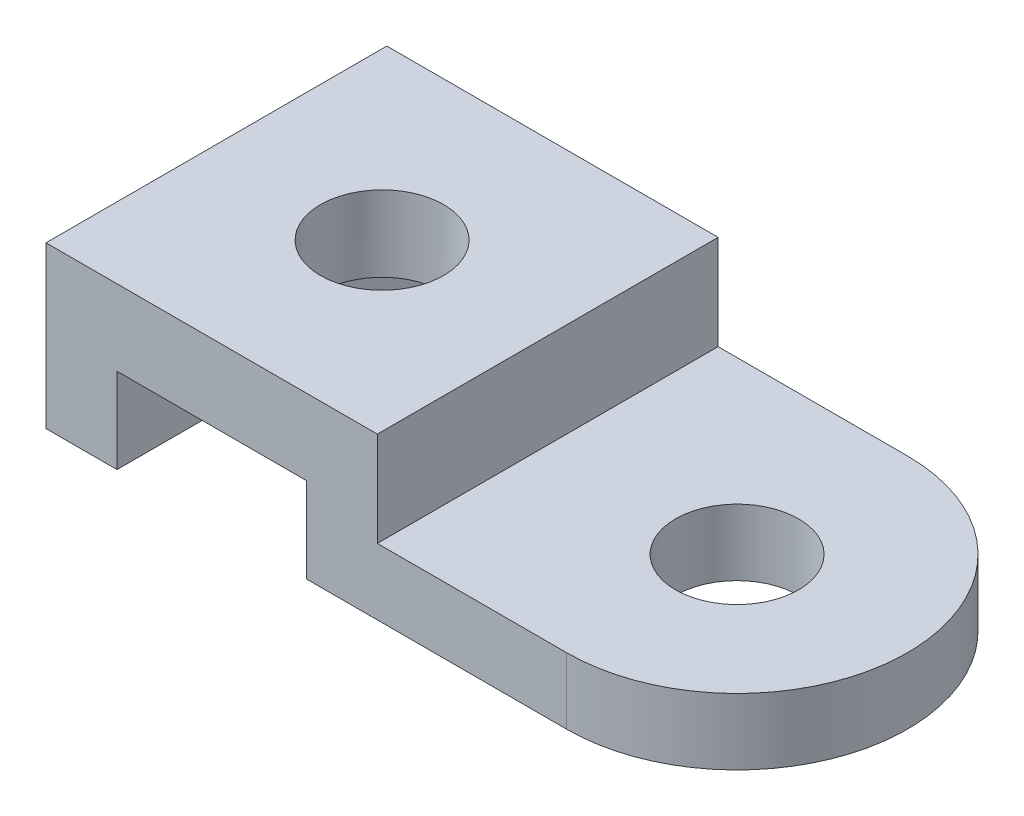
ISO-10303-21;
HEADER;
FILE_DESCRIPTION(('STEP AP214'),'2;1');
FILE_NAME('part.step','',(''),(''),'','','');
FILE_SCHEMA(('AUTOMOTIVE_DESIGN { 1 0 10303 214 1 1 1 1 }'));
ENDSEC;
DATA;
#1=APPLICATION_CONTEXT('core data for automotive mechanical design processes');
#2=APPLICATION_PROTOCOL_DEFINITION('international standard','automotive_design',2000,#1);
#3=PRODUCT_CONTEXT('',#1,'mechanical');
#4=PRODUCT('Part','Part','',(#3));
#5=PRODUCT_RELATED_PRODUCT_CATEGORY('part','',(#4));
#6=PRODUCT_DEFINITION_FORMATION('','',#4);
#7=PRODUCT_DEFINITION_CONTEXT('part definition',#1,'design');
#8=PRODUCT_DEFINITION('design','',#6,#7);
#9=PRODUCT_DEFINITION_SHAPE('','',#8);
#10=(LENGTH_UNIT() NAMED_UNIT(*) SI_UNIT(.MILLI.,.METRE.));
#11=(NAMED_UNIT(*) PLANE_ANGLE_UNIT() SI_UNIT($,.RADIAN.));
#12=(NAMED_UNIT(*) SI_UNIT($,.STERADIAN.) SOLID_ANGLE_UNIT());
#13=UNCERTAINTY_MEASURE_WITH_UNIT(LENGTH_MEASURE(1.E-05),#10,'distance_accuracy_value','');
#14=(GEOMETRIC_REPRESENTATION_CONTEXT(3) GLOBAL_UNCERTAINTY_ASSIGNED_CONTEXT((#13)) GLOBAL_UNIT_ASSIGNED_CONTEXT((#10,
#11,#12)) REPRESENTATION_CONTEXT('',''));
#15=CARTESIAN_POINT('',(0.,0.,0.));
#16=DIRECTION('',(0.,0.,1.));
#17=DIRECTION('',(1.,0.,0.));
#18=AXIS2_PLACEMENT_3D('',#15,#16,#17);
#19=CARTESIAN_POINT('',(0.,-34.,36.));
#20=DIRECTION('',(0.,0.,1.));
#21=DIRECTION('',(1.,0.,0.));
#22=AXIS2_PLACEMENT_3D('',#19,#20,#21);
#23=PLANE('',#22);
#24=DIRECTION('',(0.,-1.,0.));
#25=VECTOR('',#24,1.);
#26=CARTESIAN_POINT('',(35.,0.,36.));
#27=LINE('',#26,#25);
#28=CARTESIAN_POINT('',(35.,0.,36.));
#29=VERTEX_POINT('',#28);
#30=CARTESIAN_POINT('',(35.,-20.,36.));
#31=VERTEX_POINT('',#30);
#32=EDGE_CURVE('E220',#29,#31,#27,.T.);
#33=ORIENTED_EDGE('',*,*,#32,.F.);
#34=DIRECTION('',(1.,0.,0.));
#35=VECTOR('',#34,1.);
#36=CARTESIAN_POINT('',(0.,0.,36.));
#37=LINE('',#36,#35);
#38=CARTESIAN_POINT('',(-35.,0.,36.));
#39=VERTEX_POINT('',#38);
#40=EDGE_CURVE('E271',#39,#29,#37,.T.);
#41=ORIENTED_EDGE('',*,*,#40,.F.);
#42=DIRECTION('',(0.,1.,0.));
#43=VECTOR('',#42,1.);
#44=CARTESIAN_POINT('',(-35.,-34.,36.));
#45=LINE('',#44,#43);
#46=CARTESIAN_POINT('',(-35.,-34.,36.));
#47=VERTEX_POINT('',#46);
#48=EDGE_CURVE('E104',#47,#39,#45,.T.);
#49=ORIENTED_EDGE('',*,*,#48,.F.);
#50=DIRECTION('',(1.,0.,0.));
#51=VECTOR('',#50,1.);
#52=CARTESIAN_POINT('',(0.,-34.,36.));
#53=LINE('',#52,#51);
#54=CARTESIAN_POINT('',(-20.,-34.,36.));
#55=VERTEX_POINT('',#54);
#56=EDGE_CURVE('E251',#47,#55,#53,.T.);
#57=ORIENTED_EDGE('',*,*,#56,.T.);
#58=DIRECTION('',(0.,1.,0.));
#59=VECTOR('',#58,1.);
#60=CARTESIAN_POINT('',(-20.,-34.,36.));
#61=LINE('',#60,#59);
#62=CARTESIAN_POINT('',(-20.,-16.,36.));
#63=VERTEX_POINT('',#62);
#64=EDGE_CURVE('E192',#55,#63,#61,.T.);
#65=ORIENTED_EDGE('',*,*,#64,.T.);
#66=DIRECTION('',(1.,0.,0.));
#67=VECTOR('',#66,1.);
#68=CARTESIAN_POINT('',(-20.,-16.,36.));
#69=LINE('',#68,#67);
#70=CARTESIAN_POINT('',(20.,-16.,36.));
#71=VERTEX_POINT('',#70);
#72=EDGE_CURVE('E211',#63,#71,#69,.T.);
#73=ORIENTED_EDGE('',*,*,#72,.T.);
#74=DIRECTION('',(0.,-1.,0.));
#75=VECTOR('',#74,1.);
#76=CARTESIAN_POINT('',(20.,-16.,36.));
#77=LINE('',#76,#75);
#78=CARTESIAN_POINT('',(20.,-34.,36.));
#79=VERTEX_POINT('',#78);
#80=EDGE_CURVE('E175',#71,#79,#77,.T.);
#81=ORIENTED_EDGE('',*,*,#80,.T.);
#82=CARTESIAN_POINT('',(75.,-34.,36.));
#83=VERTEX_POINT('',#82);
#84=EDGE_CURVE('E249',#79,#83,#53,.T.);
#85=ORIENTED_EDGE('',*,*,#84,.T.);
#86=DIRECTION('',(0.,1.,0.));
#87=VECTOR('',#86,1.);
#88=CARTESIAN_POINT('',(75.,-34.,36.));
#89=LINE('',#88,#87);
#90=CARTESIAN_POINT('',(75.,-20.,36.));
#91=VERTEX_POINT('',#90);
#92=EDGE_CURVE('E266',#83,#91,#89,.T.);
#93=ORIENTED_EDGE('',*,*,#92,.T.);
#94=DIRECTION('',(-1.,0.,0.));
#95=VECTOR('',#94,1.);
#96=CARTESIAN_POINT('',(75.,-20.,36.));
#97=LINE('',#96,#95);
#98=EDGE_CURVE('E216',#91,#31,#97,.T.);
#99=ORIENTED_EDGE('',*,*,#98,.T.);
#100=EDGE_LOOP('',(#33,#41,#49,#57,#65,#73,#81,#85,#93,#99));
#101=FACE_BOUND('',#100,.T.);
#102=ADVANCED_FACE('F94',(#101),#23,.T.);
#103=CARTESIAN_POINT('',(0.,-34.,-36.));
#104=DIRECTION('',(0.,0.,1.));
#105=DIRECTION('',(1.,0.,0.));
#106=AXIS2_PLACEMENT_3D('',#103,#104,#105);
#107=PLANE('',#106);
#108=DIRECTION('',(1.,0.,0.));
#109=VECTOR('',#108,1.);
#110=CARTESIAN_POINT('',(0.,0.,-36.));
#111=LINE('',#110,#109);
#112=CARTESIAN_POINT('',(-35.,0.,-36.));
#113=VERTEX_POINT('',#112);
#114=CARTESIAN_POINT('',(35.,0.,-36.));
#115=VERTEX_POINT('',#114);
#116=EDGE_CURVE('E275',#113,#115,#111,.T.);
#117=ORIENTED_EDGE('',*,*,#116,.T.);
#118=DIRECTION('',(0.,-1.,0.));
#119=VECTOR('',#118,1.);
#120=CARTESIAN_POINT('',(35.,0.,-36.));
#121=LINE('',#120,#119);
#122=CARTESIAN_POINT('',(35.,-20.,-36.));
#123=VERTEX_POINT('',#122);
#124=EDGE_CURVE('E119',#115,#123,#121,.T.);
#125=ORIENTED_EDGE('',*,*,#124,.T.);
#126=DIRECTION('',(1.,0.,0.));
#127=VECTOR('',#126,1.);
#128=CARTESIAN_POINT('',(75.,-20.,-36.));
#129=LINE('',#128,#127);
#130=CARTESIAN_POINT('',(75.,-20.,-36.));
#131=VERTEX_POINT('',#130);
#132=EDGE_CURVE('E201',#123,#131,#129,.T.);
#133=ORIENTED_EDGE('',*,*,#132,.T.);
#134=DIRECTION('',(0.,1.,0.));
#135=VECTOR('',#134,1.);
#136=CARTESIAN_POINT('',(75.,-34.,-36.));
#137=LINE('',#136,#135);
#138=CARTESIAN_POINT('',(75.,-34.,-36.));
#139=VERTEX_POINT('',#138);
#140=EDGE_CURVE('E287',#139,#131,#137,.T.);
#141=ORIENTED_EDGE('',*,*,#140,.F.);
#142=DIRECTION('',(1.,0.,0.));
#143=VECTOR('',#142,1.);
#144=CARTESIAN_POINT('',(0.,-34.,-36.));
#145=LINE('',#144,#143);
#146=CARTESIAN_POINT('',(20.,-34.,-36.));
#147=VERTEX_POINT('',#146);
#148=EDGE_CURVE('E199',#147,#139,#145,.T.);
#149=ORIENTED_EDGE('',*,*,#148,.F.);
#150=DIRECTION('',(0.,-1.,0.));
#151=VECTOR('',#150,1.);
#152=CARTESIAN_POINT('',(20.,-16.,-36.));
#153=LINE('',#152,#151);
#154=CARTESIAN_POINT('',(20.,-16.,-36.));
#155=VERTEX_POINT('',#154);
#156=EDGE_CURVE('E111',#155,#147,#153,.T.);
#157=ORIENTED_EDGE('',*,*,#156,.F.);
#158=DIRECTION('',(1.,0.,0.));
#159=VECTOR('',#158,1.);
#160=CARTESIAN_POINT('',(-20.,-16.,-36.));
#161=LINE('',#160,#159);
#162=CARTESIAN_POINT('',(-20.,-16.,-36.));
#163=VERTEX_POINT('',#162);
#164=EDGE_CURVE('E184',#163,#155,#161,.T.);
#165=ORIENTED_EDGE('',*,*,#164,.F.);
#166=DIRECTION('',(0.,1.,0.));
#167=VECTOR('',#166,1.);
#168=CARTESIAN_POINT('',(-20.,-34.,-36.));
#169=LINE('',#168,#167);
#170=CARTESIAN_POINT('',(-20.,-34.,-36.));
#171=VERTEX_POINT('',#170);
#172=EDGE_CURVE('E181',#171,#163,#169,.T.);
#173=ORIENTED_EDGE('',*,*,#172,.F.);
#174=CARTESIAN_POINT('',(-35.,-34.,-36.));
#175=VERTEX_POINT('',#174);
#176=EDGE_CURVE('E258',#175,#171,#145,.T.);
#177=ORIENTED_EDGE('',*,*,#176,.F.);
#178=DIRECTION('',(0.,1.,0.));
#179=VECTOR('',#178,1.);
#180=CARTESIAN_POINT('',(-35.,-34.,-36.));
#181=LINE('',#180,#179);
#182=EDGE_CURVE('E283',#175,#113,#181,.T.);
#183=ORIENTED_EDGE('',*,*,#182,.T.);
#184=EDGE_LOOP('',(#117,#125,#133,#141,#149,#157,#165,#173,#177,#183));
#185=FACE_BOUND('',#184,.T.);
#186=ADVANCED_FACE('F196',(#185),#107,.F.);
#187=CARTESIAN_POINT('',(0.,-34.,0.));
#188=DIRECTION('',(0.,1.,0.));
#189=DIRECTION('',(0.,0.,1.));
#190=AXIS2_PLACEMENT_3D('',#187,#188,#189);
#191=CYLINDRICAL_SURFACE('',#190,13.);
#192=CARTESIAN_POINT('',(0.,0.,0.));
#193=DIRECTION('',(0.,1.,0.));
#194=DIRECTION('',(0.,0.,1.));
#195=AXIS2_PLACEMENT_3D('',#192,#193,#194);
#196=CIRCLE('',#195,13.);
#197=CARTESIAN_POINT('',(0.,0.,13.));
#198=VERTEX_POINT('',#197);
#199=EDGE_CURVE('E267',#198,#198,#196,.T.);
#200=ORIENTED_EDGE('',*,*,#199,.T.);
#201=EDGE_LOOP('',(#200));
#202=FACE_BOUND('',#201,.T.);
#203=CARTESIAN_POINT('',(0.,-16.,0.));
#204=DIRECTION('',(0.,-1.,0.));
#205=DIRECTION('',(0.,0.,-1.));
#206=AXIS2_PLACEMENT_3D('',#203,#204,#205);
#207=CIRCLE('',#206,13.);
#208=CARTESIAN_POINT('',(0.,-16.,-13.));
#209=VERTEX_POINT('',#208);
#210=EDGE_CURVE('E98',#209,#209,#207,.F.);
#211=ORIENTED_EDGE('',*,*,#210,.F.);
#212=EDGE_LOOP('',(#211));
#213=FACE_BOUND('',#212,.T.);
#214=ADVANCED_FACE('F336',(#202,#213),#191,.F.);
#215=CARTESIAN_POINT('',(75.,-34.,0.));
#216=DIRECTION('',(0.,1.,0.));
#217=DIRECTION('',(0.,0.,1.));
#218=AXIS2_PLACEMENT_3D('',#215,#216,#217);
#219=CYLINDRICAL_SURFACE('',#218,13.);
#220=CARTESIAN_POINT('',(75.,-34.,0.));
#221=DIRECTION('',(0.,1.,0.));
#222=DIRECTION('',(0.,0.,1.));
#223=AXIS2_PLACEMENT_3D('',#220,#221,#222);
#224=CIRCLE('',#223,13.);
#225=CARTESIAN_POINT('',(75.,-34.,13.));
#226=VERTEX_POINT('',#225);
#227=EDGE_CURVE('E245',#226,#226,#224,.T.);
#228=ORIENTED_EDGE('',*,*,#227,.F.);
#229=EDGE_LOOP('',(#228));
#230=FACE_BOUND('',#229,.T.);
#231=CARTESIAN_POINT('',(75.,-20.,0.));
#232=DIRECTION('',(0.,1.,0.));
#233=DIRECTION('',(-1.,0.,0.));
#234=AXIS2_PLACEMENT_3D('',#231,#232,#233);
#235=CIRCLE('',#234,13.);
#236=CARTESIAN_POINT('',(62.,-20.,0.));
#237=VERTEX_POINT('',#236);
#238=EDGE_CURVE('E229',#237,#237,#235,.F.);
#239=ORIENTED_EDGE('',*,*,#238,.F.);
#240=EDGE_LOOP('',(#239));
#241=FACE_BOUND('',#240,.T.);
#242=ADVANCED_FACE('F96',(#230,#241),#219,.F.);
#243=CARTESIAN_POINT('',(75.,-34.,0.));
#244=DIRECTION('',(0.,1.,0.));
#245=DIRECTION('',(0.,0.,1.));
#246=AXIS2_PLACEMENT_3D('',#243,#244,#245);
#247=CYLINDRICAL_SURFACE('',#246,36.);
#248=CARTESIAN_POINT('',(75.,-34.,0.));
#249=DIRECTION('',(0.,1.,0.));
#250=DIRECTION('',(0.,0.,1.));
#251=AXIS2_PLACEMENT_3D('',#248,#249,#250);
#252=CIRCLE('',#251,36.);
#253=EDGE_CURVE('E255',#83,#139,#252,.T.);
#254=ORIENTED_EDGE('',*,*,#253,.T.);
#255=ORIENTED_EDGE('',*,*,#140,.T.);
#256=CARTESIAN_POINT('',(75.,-20.,0.));
#257=DIRECTION('',(0.,1.,0.));
#258=DIRECTION('',(-1.,0.,0.));
#259=AXIS2_PLACEMENT_3D('',#256,#257,#258);
#260=CIRCLE('',#259,36.);
#261=EDGE_CURVE('E13',#131,#91,#260,.F.);
#262=ORIENTED_EDGE('',*,*,#261,.T.);
#263=ORIENTED_EDGE('',*,*,#92,.F.);
#264=EDGE_LOOP('',(#254,#255,#262,#263));
#265=FACE_BOUND('',#264,.T.);
#266=ADVANCED_FACE('F299',(#265),#247,.T.);
#267=CARTESIAN_POINT('',(0.,-34.,0.));
#268=DIRECTION('',(0.,1.,0.));
#269=DIRECTION('',(0.,0.,1.));
#270=AXIS2_PLACEMENT_3D('',#267,#268,#269);
#271=PLANE('',#270);
#272=DIRECTION('',(0.,0.,1.));
#273=VECTOR('',#272,1.);
#274=CARTESIAN_POINT('',(-20.,-34.,-36.));
#275=LINE('',#274,#273);
#276=EDGE_CURVE('E230',#171,#55,#275,.T.);
#277=ORIENTED_EDGE('',*,*,#276,.T.);
#278=ORIENTED_EDGE('',*,*,#56,.F.);
#279=DIRECTION('',(0.,0.,-1.));
#280=VECTOR('',#279,1.);
#281=CARTESIAN_POINT('',(-35.,-34.,0.));
#282=LINE('',#281,#280);
#283=EDGE_CURVE('E262',#47,#175,#282,.T.);
#284=ORIENTED_EDGE('',*,*,#283,.T.);
#285=ORIENTED_EDGE('',*,*,#176,.T.);
#286=EDGE_LOOP('',(#277,#278,#284,#285));
#287=FACE_BOUND('',#286,.T.);
#288=ADVANCED_FACE('F319',(#287),#271,.F.);
#289=ORIENTED_EDGE('',*,*,#227,.T.);
#290=EDGE_LOOP('',(#289));
#291=FACE_BOUND('',#290,.T.);
#292=DIRECTION('',(0.,0.,1.));
#293=VECTOR('',#292,1.);
#294=CARTESIAN_POINT('',(20.,-34.,-36.));
#295=LINE('',#294,#293);
#296=EDGE_CURVE('E180',#147,#79,#295,.T.);
#297=ORIENTED_EDGE('',*,*,#296,.F.);
#298=ORIENTED_EDGE('',*,*,#148,.T.);
#299=ORIENTED_EDGE('',*,*,#253,.F.);
#300=ORIENTED_EDGE('',*,*,#84,.F.);
#301=EDGE_LOOP('',(#297,#298,#299,#300));
#302=FACE_BOUND('',#301,.T.);
#303=ADVANCED_FACE('F301',(#291,#302),#271,.F.);
#304=CARTESIAN_POINT('',(-35.,-34.,0.));
#305=DIRECTION('',(1.,0.,0.));
#306=DIRECTION('',(0.,0.,-1.));
#307=AXIS2_PLACEMENT_3D('',#304,#305,#306);
#308=PLANE('',#307);
#309=DIRECTION('',(0.,0.,-1.));
#310=VECTOR('',#309,1.);
#311=CARTESIAN_POINT('',(-35.,0.,0.));
#312=LINE('',#311,#310);
#313=EDGE_CURVE('E250',#39,#113,#312,.T.);
#314=ORIENTED_EDGE('',*,*,#313,.T.);
#315=ORIENTED_EDGE('',*,*,#182,.F.);
#316=ORIENTED_EDGE('',*,*,#283,.F.);
#317=ORIENTED_EDGE('',*,*,#48,.T.);
#318=EDGE_LOOP('',(#314,#315,#316,#317));
#319=FACE_BOUND('',#318,.T.);
#320=ADVANCED_FACE('F315',(#319),#308,.F.);
#321=CARTESIAN_POINT('',(0.,0.,0.));
#322=DIRECTION('',(0.,1.,0.));
#323=DIRECTION('',(0.,0.,1.));
#324=AXIS2_PLACEMENT_3D('',#321,#322,#323);
#325=PLANE('',#324);
#326=DIRECTION('',(0.,0.,1.));
#327=VECTOR('',#326,1.);
#328=CARTESIAN_POINT('',(35.,0.,-36.));
#329=LINE('',#328,#327);
#330=EDGE_CURVE('E234',#115,#29,#329,.T.);
#331=ORIENTED_EDGE('',*,*,#330,.F.);
#332=ORIENTED_EDGE('',*,*,#116,.F.);
#333=ORIENTED_EDGE('',*,*,#313,.F.);
#334=ORIENTED_EDGE('',*,*,#40,.T.);
#335=EDGE_LOOP('',(#331,#332,#333,#334));
#336=FACE_BOUND('',#335,.T.);
#337=ORIENTED_EDGE('',*,*,#199,.F.);
#338=EDGE_LOOP('',(#337));
#339=FACE_BOUND('',#338,.T.);
#340=ADVANCED_FACE('F311',(#336,#339),#325,.T.);
#341=CARTESIAN_POINT('',(35.,0.,-36.));
#342=DIRECTION('',(-1.,0.,0.));
#343=DIRECTION('',(0.,0.,1.));
#344=AXIS2_PLACEMENT_3D('',#341,#342,#343);
#345=PLANE('',#344);
#346=ORIENTED_EDGE('',*,*,#32,.T.);
#347=DIRECTION('',(0.,0.,1.));
#348=VECTOR('',#347,1.);
#349=CARTESIAN_POINT('',(35.,-20.,-36.));
#350=LINE('',#349,#348);
#351=EDGE_CURVE('E237',#123,#31,#350,.T.);
#352=ORIENTED_EDGE('',*,*,#351,.F.);
#353=ORIENTED_EDGE('',*,*,#124,.F.);
#354=ORIENTED_EDGE('',*,*,#330,.T.);
#355=EDGE_LOOP('',(#346,#352,#353,#354));
#356=FACE_BOUND('',#355,.T.);
#357=ADVANCED_FACE('F307',(#356),#345,.F.);
#358=CARTESIAN_POINT('',(75.,-20.,-36.));
#359=DIRECTION('',(0.,1.,0.));
#360=DIRECTION('',(-1.,0.,0.));
#361=AXIS2_PLACEMENT_3D('',#358,#359,#360);
#362=PLANE('',#361);
#363=ORIENTED_EDGE('',*,*,#132,.F.);
#364=ORIENTED_EDGE('',*,*,#351,.T.);
#365=ORIENTED_EDGE('',*,*,#98,.F.);
#366=ORIENTED_EDGE('',*,*,#261,.F.);
#367=EDGE_LOOP('',(#363,#364,#365,#366));
#368=FACE_BOUND('',#367,.T.);
#369=ORIENTED_EDGE('',*,*,#238,.T.);
#370=EDGE_LOOP('',(#369));
#371=FACE_BOUND('',#370,.T.);
#372=ADVANCED_FACE('F305',(#368,#371),#362,.T.);
#373=CARTESIAN_POINT('',(-20.,-16.,-36.));
#374=DIRECTION('',(0.,-1.,0.));
#375=DIRECTION('',(0.,0.,-1.));
#376=AXIS2_PLACEMENT_3D('',#373,#374,#375);
#377=PLANE('',#376);
#378=ORIENTED_EDGE('',*,*,#72,.F.);
#379=DIRECTION('',(0.,0.,1.));
#380=VECTOR('',#379,1.);
#381=CARTESIAN_POINT('',(-20.,-16.,-36.));
#382=LINE('',#381,#380);
#383=EDGE_CURVE('E187',#163,#63,#382,.T.);
#384=ORIENTED_EDGE('',*,*,#383,.F.);
#385=ORIENTED_EDGE('',*,*,#164,.T.);
#386=DIRECTION('',(0.,0.,1.));
#387=VECTOR('',#386,1.);
#388=CARTESIAN_POINT('',(20.,-16.,-36.));
#389=LINE('',#388,#387);
#390=EDGE_CURVE('E171',#155,#71,#389,.T.);
#391=ORIENTED_EDGE('',*,*,#390,.T.);
#392=EDGE_LOOP('',(#378,#384,#385,#391));
#393=FACE_BOUND('',#392,.T.);
#394=ORIENTED_EDGE('',*,*,#210,.T.);
#395=EDGE_LOOP('',(#394));
#396=FACE_BOUND('',#395,.T.);
#397=ADVANCED_FACE('F185',(#393,#396),#377,.T.);
#398=CARTESIAN_POINT('',(-20.,-34.,-36.));
#399=DIRECTION('',(1.,0.,0.));
#400=DIRECTION('',(0.,0.,-1.));
#401=AXIS2_PLACEMENT_3D('',#398,#399,#400);
#402=PLANE('',#401);
#403=ORIENTED_EDGE('',*,*,#64,.F.);
#404=ORIENTED_EDGE('',*,*,#276,.F.);
#405=ORIENTED_EDGE('',*,*,#172,.T.);
#406=ORIENTED_EDGE('',*,*,#383,.T.);
#407=EDGE_LOOP('',(#403,#404,#405,#406));
#408=FACE_BOUND('',#407,.T.);
#409=ADVANCED_FACE('F321',(#408),#402,.T.);
#410=CARTESIAN_POINT('',(20.,-16.,-36.));
#411=DIRECTION('',(-1.,0.,0.));
#412=DIRECTION('',(0.,-1.,0.));
#413=AXIS2_PLACEMENT_3D('',#410,#411,#412);
#414=PLANE('',#413);
#415=ORIENTED_EDGE('',*,*,#80,.F.);
#416=ORIENTED_EDGE('',*,*,#390,.F.);
#417=ORIENTED_EDGE('',*,*,#156,.T.);
#418=ORIENTED_EDGE('',*,*,#296,.T.);
#419=EDGE_LOOP('',(#415,#416,#417,#418));
#420=FACE_BOUND('',#419,.T.);
#421=ADVANCED_FACE('F173',(#420),#414,.T.);
#422=CLOSED_SHELL('',(#102,#186,#214,#242,#266,#288,#303,#320,#340,#357,#372,#397,#409,#421));
#423=MANIFOLD_SOLID_BREP('B2',#422);
#424=ADVANCED_BREP_SHAPE_REPRESENTATION('',(#18,#423),#14);
#425=SHAPE_DEFINITION_REPRESENTATION(#9,#424);
ENDSEC;
END-ISO-10303-21;
